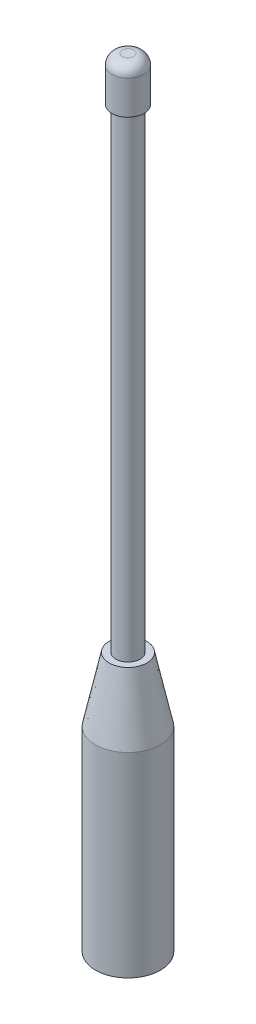
ISO-10303-21;
HEADER;
FILE_DESCRIPTION(('STEP AP214'),'2;1');
FILE_NAME('part.step','',(''),(''),'','','');
FILE_SCHEMA(('AUTOMOTIVE_DESIGN { 1 0 10303 214 1 1 1 1 }'));
ENDSEC;
DATA;
#1=APPLICATION_CONTEXT('core data for automotive mechanical design processes');
#2=APPLICATION_PROTOCOL_DEFINITION('international standard','automotive_design',2000,#1);
#3=PRODUCT_CONTEXT('',#1,'mechanical');
#4=PRODUCT('Part','Part','',(#3));
#5=PRODUCT_RELATED_PRODUCT_CATEGORY('part','',(#4));
#6=PRODUCT_DEFINITION_FORMATION('','',#4);
#7=PRODUCT_DEFINITION_CONTEXT('part definition',#1,'design');
#8=PRODUCT_DEFINITION('design','',#6,#7);
#9=PRODUCT_DEFINITION_SHAPE('','',#8);
#10=(LENGTH_UNIT() NAMED_UNIT(*) SI_UNIT(.MILLI.,.METRE.));
#11=(NAMED_UNIT(*) PLANE_ANGLE_UNIT() SI_UNIT($,.RADIAN.));
#12=(NAMED_UNIT(*) SI_UNIT($,.STERADIAN.) SOLID_ANGLE_UNIT());
#13=UNCERTAINTY_MEASURE_WITH_UNIT(LENGTH_MEASURE(1.E-05),#10,'distance_accuracy_value','');
#14=(GEOMETRIC_REPRESENTATION_CONTEXT(3) GLOBAL_UNCERTAINTY_ASSIGNED_CONTEXT((#13)) GLOBAL_UNIT_ASSIGNED_CONTEXT((#10,
#11,#12)) REPRESENTATION_CONTEXT('',''));
#15=CARTESIAN_POINT('',(0.,0.,0.));
#16=DIRECTION('',(0.,0.,1.));
#17=DIRECTION('',(1.,0.,0.));
#18=AXIS2_PLACEMENT_3D('',#15,#16,#17);
#19=CARTESIAN_POINT('',(0.,152.4,0.));
#20=DIRECTION('',(0.,-1.,0.));
#21=DIRECTION('',(0.,0.,-1.));
#22=AXIS2_PLACEMENT_3D('',#19,#20,#21);
#23=CYLINDRICAL_SURFACE('',#22,2.38125);
#24=CARTESIAN_POINT('',(0.,50.8,0.));
#25=DIRECTION('',(0.,1.,0.));
#26=DIRECTION('',(0.,0.,1.));
#27=AXIS2_PLACEMENT_3D('',#24,#25,#26);
#28=CIRCLE('',#27,2.38125);
#29=CARTESIAN_POINT('',(0.,50.8,2.38125));
#30=VERTEX_POINT('',#29);
#31=EDGE_CURVE('E60',#30,#30,#28,.T.);
#32=ORIENTED_EDGE('',*,*,#31,.T.);
#33=EDGE_LOOP('',(#32));
#34=FACE_BOUND('',#33,.T.);
#35=CARTESIAN_POINT('',(0.,143.764,0.));
#36=DIRECTION('',(0.,1.,0.));
#37=DIRECTION('',(0.,0.,1.));
#38=AXIS2_PLACEMENT_3D('',#35,#36,#37);
#39=CIRCLE('',#38,2.38125);
#40=CARTESIAN_POINT('',(0.,143.764,2.38125));
#41=VERTEX_POINT('',#40);
#42=EDGE_CURVE('E48',#41,#41,#39,.T.);
#43=ORIENTED_EDGE('',*,*,#42,.F.);
#44=EDGE_LOOP('',(#43));
#45=FACE_BOUND('',#44,.T.);
#46=ADVANCED_FACE('F37',(#34,#45),#23,.T.);
#47=CARTESIAN_POINT('',(0.,50.8,0.));
#48=DIRECTION('',(0.,-1.,0.));
#49=DIRECTION('',(0.,0.,-1.));
#50=AXIS2_PLACEMENT_3D('',#47,#48,#49);
#51=CYLINDRICAL_SURFACE('',#50,6.35);
#52=CARTESIAN_POINT('',(0.,38.2599999999999,0.));
#53=DIRECTION('',(0.,1.,0.));
#54=DIRECTION('',(0.,0.,1.));
#55=AXIS2_PLACEMENT_3D('',#52,#53,#54);
#56=CIRCLE('',#55,6.35);
#57=CARTESIAN_POINT('',(0.,38.2599999999999,6.35));
#58=VERTEX_POINT('',#57);
#59=EDGE_CURVE('E52',#58,#58,#56,.F.);
#60=ORIENTED_EDGE('',*,*,#59,.T.);
#61=EDGE_LOOP('',(#60));
#62=FACE_BOUND('',#61,.T.);
#63=CARTESIAN_POINT('',(0.,0.,0.));
#64=DIRECTION('',(0.,1.,0.));
#65=DIRECTION('',(0.,0.,1.));
#66=AXIS2_PLACEMENT_3D('',#63,#64,#65);
#67=CIRCLE('',#66,6.35);
#68=CARTESIAN_POINT('',(0.,0.,6.35));
#69=VERTEX_POINT('',#68);
#70=EDGE_CURVE('E63',#69,#69,#67,.T.);
#71=ORIENTED_EDGE('',*,*,#70,.T.);
#72=EDGE_LOOP('',(#71));
#73=FACE_BOUND('',#72,.T.);
#74=ADVANCED_FACE('F85',(#62,#73),#51,.T.);
#75=CARTESIAN_POINT('',(0.,50.8,0.));
#76=DIRECTION('',(0.,1.,0.));
#77=DIRECTION('',(0.,0.,1.));
#78=AXIS2_PLACEMENT_3D('',#75,#76,#77);
#79=PLANE('',#78);
#80=CARTESIAN_POINT('',(0.,50.8,0.));
#81=DIRECTION('',(0.,1.,0.));
#82=DIRECTION('',(0.,0.,1.));
#83=AXIS2_PLACEMENT_3D('',#80,#81,#82);
#84=CIRCLE('',#83,3.68454071665793);
#85=CARTESIAN_POINT('',(0.,50.8,3.68454071665793));
#86=VERTEX_POINT('',#85);
#87=EDGE_CURVE('E57',#86,#86,#84,.T.);
#88=ORIENTED_EDGE('',*,*,#87,.T.);
#89=EDGE_LOOP('',(#88));
#90=FACE_BOUND('',#89,.T.);
#91=ORIENTED_EDGE('',*,*,#31,.F.);
#92=EDGE_LOOP('',(#91));
#93=FACE_BOUND('',#92,.T.);
#94=ADVANCED_FACE('F91',(#90,#93),#79,.T.);
#95=CARTESIAN_POINT('',(0.,0.,0.));
#96=DIRECTION('',(0.,1.,0.));
#97=DIRECTION('',(0.,0.,1.));
#98=AXIS2_PLACEMENT_3D('',#95,#96,#97);
#99=PLANE('',#98);
#100=ORIENTED_EDGE('',*,*,#70,.F.);
#101=EDGE_LOOP('',(#100));
#102=FACE_BOUND('',#101,.T.);
#103=ADVANCED_FACE('F96',(#102),#99,.F.);
#104=CARTESIAN_POINT('',(0.,50.8,0.));
#105=DIRECTION('',(0.,-1.,0.));
#106=DIRECTION('',(0.,0.,-1.));
#107=AXIS2_PLACEMENT_3D('',#104,#105,#106);
#108=CONICAL_SURFACE('',#107,3.68454071665793,0.209439510239317);
#109=ORIENTED_EDGE('',*,*,#59,.F.);
#110=EDGE_LOOP('',(#109));
#111=FACE_BOUND('',#110,.T.);
#112=ORIENTED_EDGE('',*,*,#87,.F.);
#113=EDGE_LOOP('',(#112));
#114=FACE_BOUND('',#113,.T.);
#115=ADVANCED_FACE('F82',(#111,#114),#108,.T.);
#116=CARTESIAN_POINT('',(0.,143.764,0.));
#117=DIRECTION('',(0.,1.,0.));
#118=DIRECTION('',(0.,0.,1.));
#119=AXIS2_PLACEMENT_3D('',#116,#117,#118);
#120=CYLINDRICAL_SURFACE('',#119,3.14325);
#121=CARTESIAN_POINT('',(0.,150.368,0.));
#122=DIRECTION('',(0.,1.,0.));
#123=DIRECTION('',(0.,0.,1.));
#124=AXIS2_PLACEMENT_3D('',#121,#122,#123);
#125=CIRCLE('',#124,3.14325);
#126=CARTESIAN_POINT('',(0.,150.368,3.14325));
#127=VERTEX_POINT('',#126);
#128=EDGE_CURVE('E10',#127,#127,#125,.F.);
#129=ORIENTED_EDGE('',*,*,#128,.T.);
#130=EDGE_LOOP('',(#129));
#131=FACE_BOUND('',#130,.T.);
#132=CARTESIAN_POINT('',(0.,143.764,0.));
#133=DIRECTION('',(0.,1.,0.));
#134=DIRECTION('',(0.,0.,1.));
#135=AXIS2_PLACEMENT_3D('',#132,#133,#134);
#136=CIRCLE('',#135,3.14325);
#137=CARTESIAN_POINT('',(0.,143.764,3.14325));
#138=VERTEX_POINT('',#137);
#139=EDGE_CURVE('E66',#138,#138,#136,.T.);
#140=ORIENTED_EDGE('',*,*,#139,.T.);
#141=EDGE_LOOP('',(#140));
#142=FACE_BOUND('',#141,.T.);
#143=ADVANCED_FACE('F70',(#131,#142),#120,.T.);
#144=CARTESIAN_POINT('',(0.,143.764,0.));
#145=DIRECTION('',(0.,1.,0.));
#146=DIRECTION('',(0.,0.,1.));
#147=AXIS2_PLACEMENT_3D('',#144,#145,#146);
#148=PLANE('',#147);
#149=ORIENTED_EDGE('',*,*,#42,.T.);
#150=EDGE_LOOP('',(#149));
#151=FACE_BOUND('',#150,.T.);
#152=ORIENTED_EDGE('',*,*,#139,.F.);
#153=EDGE_LOOP('',(#152));
#154=FACE_BOUND('',#153,.T.);
#155=ADVANCED_FACE('F72',(#151,#154),#148,.F.);
#156=CARTESIAN_POINT('',(0.,152.4,0.));
#157=DIRECTION('',(0.,1.,0.));
#158=DIRECTION('',(0.,0.,1.));
#159=AXIS2_PLACEMENT_3D('',#156,#157,#158);
#160=PLANE('',#159);
#161=CARTESIAN_POINT('',(0.,152.4,0.));
#162=DIRECTION('',(0.,1.,0.));
#163=DIRECTION('',(0.,0.,1.));
#164=AXIS2_PLACEMENT_3D('',#161,#162,#163);
#165=CIRCLE('',#164,1.11125);
#166=CARTESIAN_POINT('',(0.,152.4,1.11125));
#167=VERTEX_POINT('',#166);
#168=EDGE_CURVE('E44',#167,#167,#165,.T.);
#169=ORIENTED_EDGE('',*,*,#168,.T.);
#170=EDGE_LOOP('',(#169));
#171=FACE_BOUND('',#170,.T.);
#172=ADVANCED_FACE('F74',(#171),#160,.T.);
#173=CARTESIAN_POINT('',(0.,150.368,0.));
#174=DIRECTION('',(0.,1.,0.));
#175=DIRECTION('',(0.,0.,1.));
#176=AXIS2_PLACEMENT_3D('',#173,#174,#175);
#177=DEGENERATE_TOROIDAL_SURFACE('',#176,1.11125,2.032,.T.);
#178=ORIENTED_EDGE('',*,*,#128,.F.);
#179=EDGE_LOOP('',(#178));
#180=FACE_BOUND('',#179,.T.);
#181=ORIENTED_EDGE('',*,*,#168,.F.);
#182=EDGE_LOOP('',(#181));
#183=FACE_BOUND('',#182,.T.);
#184=ADVANCED_FACE('F39',(#180,#183),#177,.T.);
#185=CLOSED_SHELL('',(#46,#74,#94,#103,#115,#143,#155,#172,#184));
#186=MANIFOLD_SOLID_BREP('B2',#185);
#187=ADVANCED_BREP_SHAPE_REPRESENTATION('',(#18,#186),#14);
#188=SHAPE_DEFINITION_REPRESENTATION(#9,#187);
ENDSEC;
END-ISO-10303-21;
